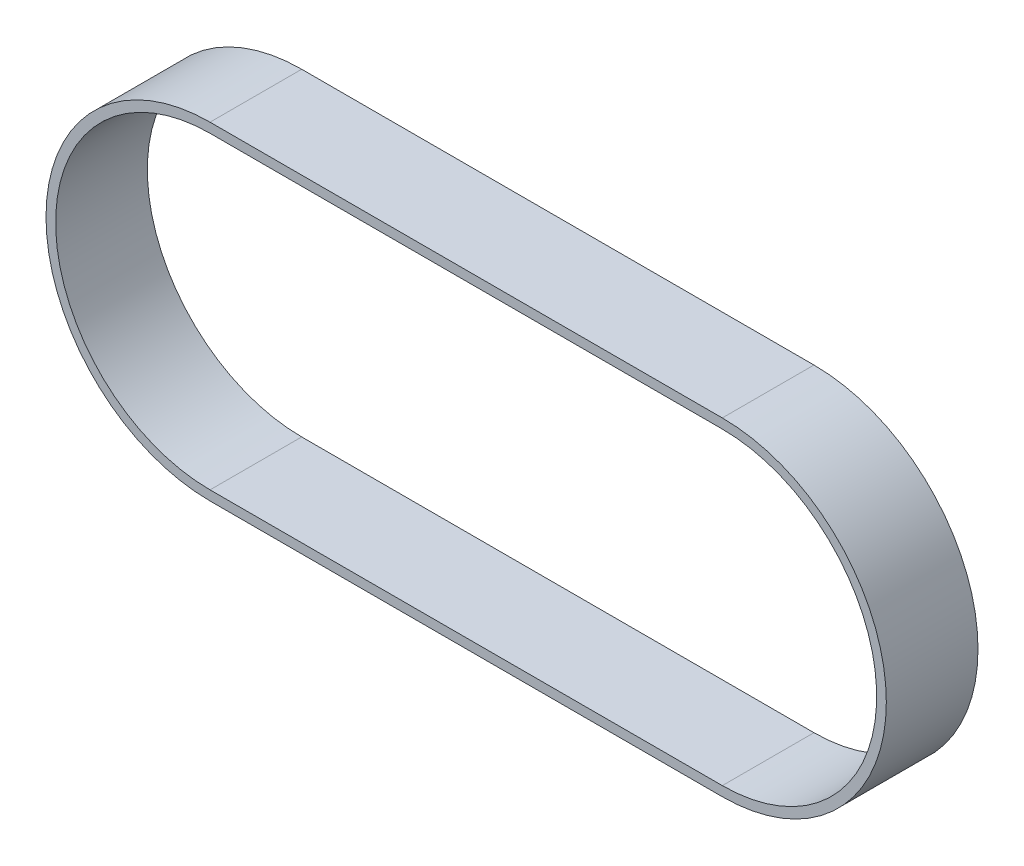
ISO-10303-21;
HEADER;
FILE_DESCRIPTION(('STEP AP214'),'2;1');
FILE_NAME('part.step','',(''),(''),'','','');
FILE_SCHEMA(('AUTOMOTIVE_DESIGN { 1 0 10303 214 1 1 1 1 }'));
ENDSEC;
DATA;
#1=APPLICATION_CONTEXT('core data for automotive mechanical design processes');
#2=APPLICATION_PROTOCOL_DEFINITION('international standard','automotive_design',2000,#1);
#3=PRODUCT_CONTEXT('',#1,'mechanical');
#4=PRODUCT('Part','Part','',(#3));
#5=PRODUCT_RELATED_PRODUCT_CATEGORY('part','',(#4));
#6=PRODUCT_DEFINITION_FORMATION('','',#4);
#7=PRODUCT_DEFINITION_CONTEXT('part definition',#1,'design');
#8=PRODUCT_DEFINITION('design','',#6,#7);
#9=PRODUCT_DEFINITION_SHAPE('','',#8);
#10=(LENGTH_UNIT() NAMED_UNIT(*) SI_UNIT(.MILLI.,.METRE.));
#11=(NAMED_UNIT(*) PLANE_ANGLE_UNIT() SI_UNIT($,.RADIAN.));
#12=(NAMED_UNIT(*) SI_UNIT($,.STERADIAN.) SOLID_ANGLE_UNIT());
#13=UNCERTAINTY_MEASURE_WITH_UNIT(LENGTH_MEASURE(1.E-05),#10,'distance_accuracy_value','');
#14=(GEOMETRIC_REPRESENTATION_CONTEXT(3) GLOBAL_UNCERTAINTY_ASSIGNED_CONTEXT((#13)) GLOBAL_UNIT_ASSIGNED_CONTEXT((#10,
#11,#12)) REPRESENTATION_CONTEXT('',''));
#15=CARTESIAN_POINT('',(0.,0.,0.));
#16=DIRECTION('',(0.,0.,1.));
#17=DIRECTION('',(1.,0.,0.));
#18=AXIS2_PLACEMENT_3D('',#15,#16,#17);
#19=CARTESIAN_POINT('',(0.,0.,-9.5));
#20=DIRECTION('',(0.,0.,1.));
#21=DIRECTION('',(1.,0.,0.));
#22=AXIS2_PLACEMENT_3D('',#19,#20,#21);
#23=CYLINDRICAL_SURFACE('',#22,34.);
#24=DIRECTION('',(0.,0.,1.));
#25=VECTOR('',#24,1.);
#26=CARTESIAN_POINT('',(0.,33.9999999999999,-9.5));
#27=LINE('',#26,#25);
#28=CARTESIAN_POINT('',(0.,33.9999999999999,-9.5));
#29=VERTEX_POINT('',#28);
#30=CARTESIAN_POINT('',(0.,33.9999999999999,9.5));
#31=VERTEX_POINT('',#30);
#32=EDGE_CURVE('E84',#29,#31,#27,.T.);
#33=ORIENTED_EDGE('',*,*,#32,.T.);
#34=CARTESIAN_POINT('',(0.,0.,9.5));
#35=DIRECTION('',(0.,0.,-1.));
#36=DIRECTION('',(-1.,0.,0.));
#37=AXIS2_PLACEMENT_3D('',#34,#35,#36);
#38=CIRCLE('',#37,34.);
#39=CARTESIAN_POINT('',(1.39717615263473E-13,-34.0000000000001,9.5));
#40=VERTEX_POINT('',#39);
#41=EDGE_CURVE('E176',#40,#31,#38,.F.);
#42=ORIENTED_EDGE('',*,*,#41,.F.);
#43=DIRECTION('',(0.,0.,1.));
#44=VECTOR('',#43,1.);
#45=CARTESIAN_POINT('',(1.39717615263473E-13,-34.0000000000001,-9.5));
#46=LINE('',#45,#44);
#47=CARTESIAN_POINT('',(1.39717615263473E-13,-34.0000000000001,-9.5));
#48=VERTEX_POINT('',#47);
#49=EDGE_CURVE('E12',#48,#40,#46,.T.);
#50=ORIENTED_EDGE('',*,*,#49,.F.);
#51=CARTESIAN_POINT('',(0.,0.,-9.5));
#52=DIRECTION('',(0.,0.,-1.));
#53=DIRECTION('',(-1.,0.,0.));
#54=AXIS2_PLACEMENT_3D('',#51,#52,#53);
#55=CIRCLE('',#54,34.);
#56=EDGE_CURVE('E195',#48,#29,#55,.F.);
#57=ORIENTED_EDGE('',*,*,#56,.T.);
#58=EDGE_LOOP('',(#33,#42,#50,#57));
#59=FACE_BOUND('',#58,.T.);
#60=ADVANCED_FACE('F81',(#59),#23,.T.);
#61=CARTESIAN_POINT('',(1.40763219920306E-13,-34.0000000000001,-9.5));
#62=DIRECTION('',(0.,-1.,0.));
#63=DIRECTION('',(1.,0.,0.));
#64=AXIS2_PLACEMENT_3D('',#61,#62,#63);
#65=PLANE('',#64);
#66=ORIENTED_EDGE('',*,*,#49,.T.);
#67=DIRECTION('',(1.,0.,0.));
#68=VECTOR('',#67,1.);
#69=CARTESIAN_POINT('',(1.40763219920306E-13,-34.0000000000001,9.5));
#70=LINE('',#69,#68);
#71=CARTESIAN_POINT('',(-106.18,-34.0000000000003,9.5));
#72=VERTEX_POINT('',#71);
#73=EDGE_CURVE('E185',#72,#40,#70,.T.);
#74=ORIENTED_EDGE('',*,*,#73,.F.);
#75=DIRECTION('',(0.,0.,1.));
#76=VECTOR('',#75,1.);
#77=CARTESIAN_POINT('',(-106.18,-34.0000000000003,-9.5));
#78=LINE('',#77,#76);
#79=CARTESIAN_POINT('',(-106.18,-34.0000000000003,-9.5));
#80=VERTEX_POINT('',#79);
#81=EDGE_CURVE('E89',#80,#72,#78,.T.);
#82=ORIENTED_EDGE('',*,*,#81,.F.);
#83=DIRECTION('',(1.,0.,0.));
#84=VECTOR('',#83,1.);
#85=CARTESIAN_POINT('',(1.40763219920306E-13,-34.0000000000001,-9.5));
#86=LINE('',#85,#84);
#87=EDGE_CURVE('E206',#80,#48,#86,.T.);
#88=ORIENTED_EDGE('',*,*,#87,.T.);
#89=EDGE_LOOP('',(#66,#74,#82,#88));
#90=FACE_BOUND('',#89,.T.);
#91=ADVANCED_FACE('F218',(#90),#65,.T.);
#92=CARTESIAN_POINT('',(-106.18,-2.94902990916057E-13,-9.5));
#93=DIRECTION('',(0.,0.,1.));
#94=DIRECTION('',(1.,0.,0.));
#95=AXIS2_PLACEMENT_3D('',#92,#93,#94);
#96=CYLINDRICAL_SURFACE('',#95,34.);
#97=ORIENTED_EDGE('',*,*,#81,.T.);
#98=CARTESIAN_POINT('',(-106.18,-2.94902990916057E-13,9.5));
#99=DIRECTION('',(0.,0.,-1.));
#100=DIRECTION('',(-1.,0.,0.));
#101=AXIS2_PLACEMENT_3D('',#98,#99,#100);
#102=CIRCLE('',#101,34.);
#103=CARTESIAN_POINT('',(-106.18,33.9999999999997,9.5));
#104=VERTEX_POINT('',#103);
#105=EDGE_CURVE('E182',#104,#72,#102,.F.);
#106=ORIENTED_EDGE('',*,*,#105,.F.);
#107=DIRECTION('',(0.,0.,1.));
#108=VECTOR('',#107,1.);
#109=CARTESIAN_POINT('',(-106.18,33.9999999999997,-9.5));
#110=LINE('',#109,#108);
#111=CARTESIAN_POINT('',(-106.18,33.9999999999997,-9.5));
#112=VERTEX_POINT('',#111);
#113=EDGE_CURVE('E209',#112,#104,#110,.T.);
#114=ORIENTED_EDGE('',*,*,#113,.F.);
#115=CARTESIAN_POINT('',(-106.18,-2.94902990916057E-13,-9.5));
#116=DIRECTION('',(0.,0.,-1.));
#117=DIRECTION('',(-1.,0.,0.));
#118=AXIS2_PLACEMENT_3D('',#115,#116,#117);
#119=CIRCLE('',#118,34.);
#120=EDGE_CURVE('E203',#112,#80,#119,.F.);
#121=ORIENTED_EDGE('',*,*,#120,.T.);
#122=EDGE_LOOP('',(#97,#106,#114,#121));
#123=FACE_BOUND('',#122,.T.);
#124=ADVANCED_FACE('F224',(#123),#96,.T.);
#125=CARTESIAN_POINT('',(0.,33.9999999999999,-9.5));
#126=DIRECTION('',(0.,1.,0.));
#127=DIRECTION('',(-1.,0.,0.));
#128=AXIS2_PLACEMENT_3D('',#125,#126,#127);
#129=PLANE('',#128);
#130=ORIENTED_EDGE('',*,*,#113,.T.);
#131=DIRECTION('',(-1.,0.,0.));
#132=VECTOR('',#131,1.);
#133=CARTESIAN_POINT('',(0.,33.9999999999999,9.5));
#134=LINE('',#133,#132);
#135=EDGE_CURVE('E179',#31,#104,#134,.T.);
#136=ORIENTED_EDGE('',*,*,#135,.F.);
#137=ORIENTED_EDGE('',*,*,#32,.F.);
#138=DIRECTION('',(-1.,0.,0.));
#139=VECTOR('',#138,1.);
#140=CARTESIAN_POINT('',(0.,33.9999999999999,-9.5));
#141=LINE('',#140,#139);
#142=EDGE_CURVE('E200',#29,#112,#141,.T.);
#143=ORIENTED_EDGE('',*,*,#142,.T.);
#144=EDGE_LOOP('',(#130,#136,#137,#143));
#145=FACE_BOUND('',#144,.T.);
#146=ADVANCED_FACE('F213',(#145),#129,.T.);
#147=CARTESIAN_POINT('',(0.,0.,-9.5));
#148=DIRECTION('',(0.,0.,-1.));
#149=DIRECTION('',(-1.,0.,0.));
#150=AXIS2_PLACEMENT_3D('',#147,#148,#149);
#151=PLANE('',#150);
#152=CARTESIAN_POINT('',(0.,0.,-9.5));
#153=DIRECTION('',(0.,0.,1.));
#154=DIRECTION('',(-1.,0.,0.));
#155=AXIS2_PLACEMENT_3D('',#152,#153,#154);
#156=CIRCLE('',#155,32.);
#157=CARTESIAN_POINT('',(1.35927298382454E-13,-32.0000000000001,-9.5));
#158=VERTEX_POINT('',#157);
#159=CARTESIAN_POINT('',(0.,31.9999999999999,-9.5));
#160=VERTEX_POINT('',#159);
#161=EDGE_CURVE('E188',#158,#160,#156,.T.);
#162=ORIENTED_EDGE('',*,*,#161,.T.);
#163=DIRECTION('',(-1.,0.,0.));
#164=VECTOR('',#163,1.);
#165=CARTESIAN_POINT('',(-106.18,31.9999999999997,-9.5));
#166=LINE('',#165,#164);
#167=CARTESIAN_POINT('',(-106.18,31.9999999999997,-9.5));
#168=VERTEX_POINT('',#167);
#169=EDGE_CURVE('E153',#160,#168,#166,.T.);
#170=ORIENTED_EDGE('',*,*,#169,.T.);
#171=CARTESIAN_POINT('',(-106.18,-2.94902990916057E-13,-9.5));
#172=DIRECTION('',(0.,0.,1.));
#173=DIRECTION('',(-1.,0.,0.));
#174=AXIS2_PLACEMENT_3D('',#171,#172,#173);
#175=CIRCLE('',#174,32.);
#176=CARTESIAN_POINT('',(-106.18,-32.0000000000003,-9.5));
#177=VERTEX_POINT('',#176);
#178=EDGE_CURVE('E97',#168,#177,#175,.T.);
#179=ORIENTED_EDGE('',*,*,#178,.T.);
#180=DIRECTION('',(1.,0.,0.));
#181=VECTOR('',#180,1.);
#182=CARTESIAN_POINT('',(1.35927298382454E-13,-32.0000000000001,-9.5));
#183=LINE('',#182,#181);
#184=EDGE_CURVE('E158',#177,#158,#183,.T.);
#185=ORIENTED_EDGE('',*,*,#184,.T.);
#186=EDGE_LOOP('',(#162,#170,#179,#185));
#187=FACE_BOUND('',#186,.T.);
#188=ORIENTED_EDGE('',*,*,#56,.F.);
#189=ORIENTED_EDGE('',*,*,#87,.F.);
#190=ORIENTED_EDGE('',*,*,#120,.F.);
#191=ORIENTED_EDGE('',*,*,#142,.F.);
#192=EDGE_LOOP('',(#188,#189,#190,#191));
#193=FACE_BOUND('',#192,.T.);
#194=ADVANCED_FACE('F222',(#187,#193),#151,.T.);
#195=CARTESIAN_POINT('',(0.,0.,-9.5));
#196=DIRECTION('',(0.,0.,1.));
#197=DIRECTION('',(1.,0.,0.));
#198=AXIS2_PLACEMENT_3D('',#195,#196,#197);
#199=CYLINDRICAL_SURFACE('',#198,32.);
#200=DIRECTION('',(0.,0.,1.));
#201=VECTOR('',#200,1.);
#202=CARTESIAN_POINT('',(1.35927298382454E-13,-32.0000000000001,-9.5));
#203=LINE('',#202,#201);
#204=CARTESIAN_POINT('',(1.35927298382454E-13,-32.0000000000001,9.5));
#205=VERTEX_POINT('',#204);
#206=EDGE_CURVE('E163',#158,#205,#203,.T.);
#207=ORIENTED_EDGE('',*,*,#206,.T.);
#208=CARTESIAN_POINT('',(0.,0.,9.5));
#209=DIRECTION('',(0.,0.,1.));
#210=DIRECTION('',(-1.,0.,0.));
#211=AXIS2_PLACEMENT_3D('',#208,#209,#210);
#212=CIRCLE('',#211,32.);
#213=CARTESIAN_POINT('',(0.,31.9999999999999,9.5));
#214=VERTEX_POINT('',#213);
#215=EDGE_CURVE('E161',#205,#214,#212,.T.);
#216=ORIENTED_EDGE('',*,*,#215,.T.);
#217=DIRECTION('',(0.,0.,1.));
#218=VECTOR('',#217,1.);
#219=CARTESIAN_POINT('',(0.,31.9999999999999,-9.5));
#220=LINE('',#219,#218);
#221=EDGE_CURVE('E146',#160,#214,#220,.T.);
#222=ORIENTED_EDGE('',*,*,#221,.F.);
#223=ORIENTED_EDGE('',*,*,#161,.F.);
#224=EDGE_LOOP('',(#207,#216,#222,#223));
#225=FACE_BOUND('',#224,.T.);
#226=ADVANCED_FACE('F162',(#225),#199,.F.);
#227=CARTESIAN_POINT('',(1.35927298382454E-13,-32.0000000000001,-9.5));
#228=DIRECTION('',(0.,-1.,0.));
#229=DIRECTION('',(1.,0.,0.));
#230=AXIS2_PLACEMENT_3D('',#227,#228,#229);
#231=PLANE('',#230);
#232=DIRECTION('',(0.,0.,1.));
#233=VECTOR('',#232,1.);
#234=CARTESIAN_POINT('',(-106.18,-32.0000000000003,-9.5));
#235=LINE('',#234,#233);
#236=CARTESIAN_POINT('',(-106.18,-32.0000000000003,9.5));
#237=VERTEX_POINT('',#236);
#238=EDGE_CURVE('E196',#177,#237,#235,.T.);
#239=ORIENTED_EDGE('',*,*,#238,.T.);
#240=DIRECTION('',(1.,0.,0.));
#241=VECTOR('',#240,1.);
#242=CARTESIAN_POINT('',(1.35927298382454E-13,-32.0000000000001,9.5));
#243=LINE('',#242,#241);
#244=EDGE_CURVE('E172',#237,#205,#243,.T.);
#245=ORIENTED_EDGE('',*,*,#244,.T.);
#246=ORIENTED_EDGE('',*,*,#206,.F.);
#247=ORIENTED_EDGE('',*,*,#184,.F.);
#248=EDGE_LOOP('',(#239,#245,#246,#247));
#249=FACE_BOUND('',#248,.T.);
#250=ADVANCED_FACE('F267',(#249),#231,.F.);
#251=CARTESIAN_POINT('',(-106.18,-2.94902990916057E-13,-9.5));
#252=DIRECTION('',(0.,0.,1.));
#253=DIRECTION('',(1.,0.,0.));
#254=AXIS2_PLACEMENT_3D('',#251,#252,#253);
#255=CYLINDRICAL_SURFACE('',#254,32.);
#256=DIRECTION('',(0.,0.,1.));
#257=VECTOR('',#256,1.);
#258=CARTESIAN_POINT('',(-106.18,31.9999999999997,-9.5));
#259=LINE('',#258,#257);
#260=CARTESIAN_POINT('',(-106.18,31.9999999999997,9.5));
#261=VERTEX_POINT('',#260);
#262=EDGE_CURVE('E157',#168,#261,#259,.T.);
#263=ORIENTED_EDGE('',*,*,#262,.T.);
#264=CARTESIAN_POINT('',(-106.18,-2.94902990916057E-13,9.5));
#265=DIRECTION('',(0.,0.,1.));
#266=DIRECTION('',(-1.,0.,0.));
#267=AXIS2_PLACEMENT_3D('',#264,#265,#266);
#268=CIRCLE('',#267,32.);
#269=EDGE_CURVE('E170',#261,#237,#268,.T.);
#270=ORIENTED_EDGE('',*,*,#269,.T.);
#271=ORIENTED_EDGE('',*,*,#238,.F.);
#272=ORIENTED_EDGE('',*,*,#178,.F.);
#273=EDGE_LOOP('',(#263,#270,#271,#272));
#274=FACE_BOUND('',#273,.T.);
#275=ADVANCED_FACE('F276',(#274),#255,.F.);
#276=CARTESIAN_POINT('',(-106.18,31.9999999999997,-9.5));
#277=DIRECTION('',(0.,1.,0.));
#278=DIRECTION('',(-1.,0.,0.));
#279=AXIS2_PLACEMENT_3D('',#276,#277,#278);
#280=PLANE('',#279);
#281=ORIENTED_EDGE('',*,*,#221,.T.);
#282=DIRECTION('',(-1.,0.,0.));
#283=VECTOR('',#282,1.);
#284=CARTESIAN_POINT('',(-106.18,31.9999999999997,9.5));
#285=LINE('',#284,#283);
#286=EDGE_CURVE('E150',#214,#261,#285,.T.);
#287=ORIENTED_EDGE('',*,*,#286,.T.);
#288=ORIENTED_EDGE('',*,*,#262,.F.);
#289=ORIENTED_EDGE('',*,*,#169,.F.);
#290=EDGE_LOOP('',(#281,#287,#288,#289));
#291=FACE_BOUND('',#290,.T.);
#292=ADVANCED_FACE('F148',(#291),#280,.F.);
#293=CARTESIAN_POINT('',(0.,0.,9.5));
#294=DIRECTION('',(0.,0.,-1.));
#295=DIRECTION('',(-1.,0.,0.));
#296=AXIS2_PLACEMENT_3D('',#293,#294,#295);
#297=PLANE('',#296);
#298=ORIENTED_EDGE('',*,*,#41,.T.);
#299=ORIENTED_EDGE('',*,*,#135,.T.);
#300=ORIENTED_EDGE('',*,*,#105,.T.);
#301=ORIENTED_EDGE('',*,*,#73,.T.);
#302=EDGE_LOOP('',(#298,#299,#300,#301));
#303=FACE_BOUND('',#302,.T.);
#304=ORIENTED_EDGE('',*,*,#215,.F.);
#305=ORIENTED_EDGE('',*,*,#244,.F.);
#306=ORIENTED_EDGE('',*,*,#269,.F.);
#307=ORIENTED_EDGE('',*,*,#286,.F.);
#308=EDGE_LOOP('',(#304,#305,#306,#307));
#309=FACE_BOUND('',#308,.T.);
#310=ADVANCED_FACE('F168',(#303,#309),#297,.F.);
#311=CLOSED_SHELL('',(#60,#91,#124,#146,#194,#226,#250,#275,#292,#310));
#312=MANIFOLD_SOLID_BREP('B2',#311);
#313=ADVANCED_BREP_SHAPE_REPRESENTATION('',(#18,#312),#14);
#314=SHAPE_DEFINITION_REPRESENTATION(#9,#313);
ENDSEC;
END-ISO-10303-21;
